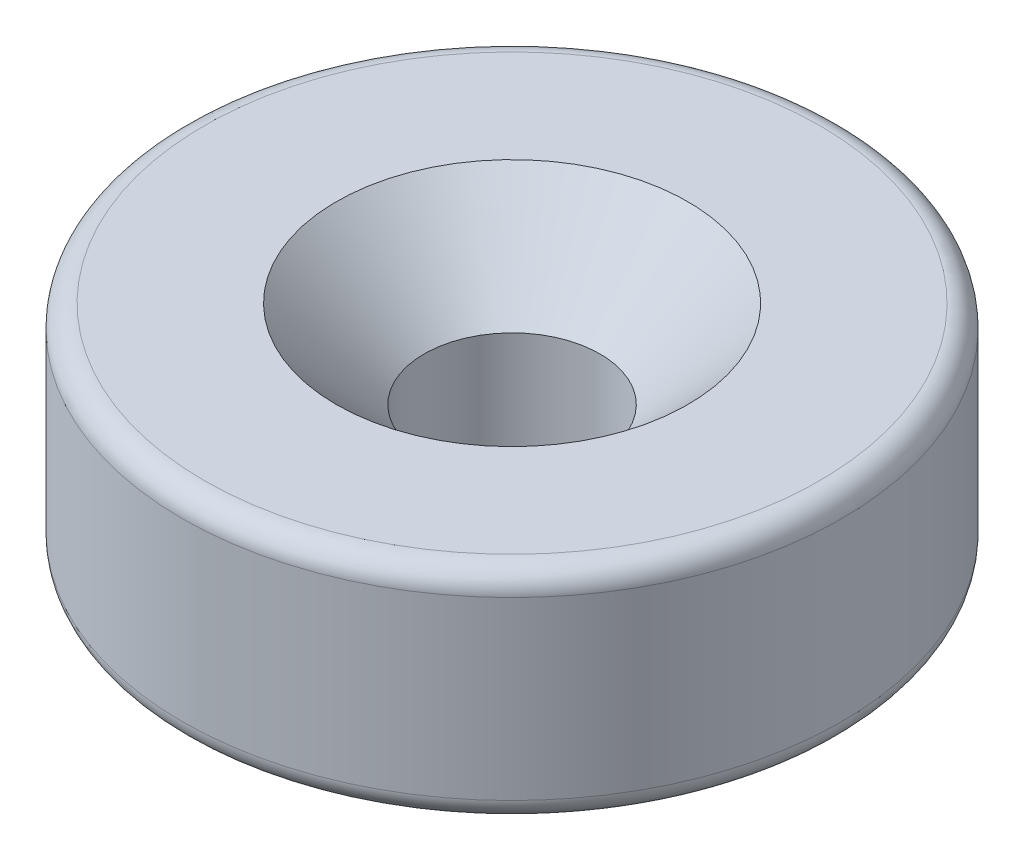
ISO-10303-21;
HEADER;
FILE_DESCRIPTION(('STEP AP214'),'2;1');
FILE_NAME('part.step','',(''),(''),'','','');
FILE_SCHEMA(('AUTOMOTIVE_DESIGN { 1 0 10303 214 1 1 1 1 }'));
ENDSEC;
DATA;
#1=APPLICATION_CONTEXT('core data for automotive mechanical design processes');
#2=APPLICATION_PROTOCOL_DEFINITION('international standard','automotive_design',2000,#1);
#3=PRODUCT_CONTEXT('',#1,'mechanical');
#4=PRODUCT('Part','Part','',(#3));
#5=PRODUCT_RELATED_PRODUCT_CATEGORY('part','',(#4));
#6=PRODUCT_DEFINITION_FORMATION('','',#4);
#7=PRODUCT_DEFINITION_CONTEXT('part definition',#1,'design');
#8=PRODUCT_DEFINITION('design','',#6,#7);
#9=PRODUCT_DEFINITION_SHAPE('','',#8);
#10=(LENGTH_UNIT() NAMED_UNIT(*) SI_UNIT(.MILLI.,.METRE.));
#11=(NAMED_UNIT(*) PLANE_ANGLE_UNIT() SI_UNIT($,.RADIAN.));
#12=(NAMED_UNIT(*) SI_UNIT($,.STERADIAN.) SOLID_ANGLE_UNIT());
#13=UNCERTAINTY_MEASURE_WITH_UNIT(LENGTH_MEASURE(1.E-05),#10,'distance_accuracy_value','');
#14=(GEOMETRIC_REPRESENTATION_CONTEXT(3) GLOBAL_UNCERTAINTY_ASSIGNED_CONTEXT((#13)) GLOBAL_UNIT_ASSIGNED_CONTEXT((#10,
#11,#12)) REPRESENTATION_CONTEXT('',''));
#15=CARTESIAN_POINT('',(0.,0.,0.));
#16=DIRECTION('',(0.,0.,1.));
#17=DIRECTION('',(1.,0.,0.));
#18=AXIS2_PLACEMENT_3D('',#15,#16,#17);
#19=CARTESIAN_POINT('',(0.,2.5,0.));
#20=DIRECTION('',(0.,1.,0.));
#21=DIRECTION('',(0.,0.,1.));
#22=AXIS2_PLACEMENT_3D('',#19,#20,#21);
#23=PLANE('',#22);
#24=CARTESIAN_POINT('',(0.,2.5,0.));
#25=DIRECTION('',(0.,1.,0.));
#26=DIRECTION('',(0.,0.,1.));
#27=AXIS2_PLACEMENT_3D('',#24,#25,#26);
#28=CIRCLE('',#27,4.00000000000001);
#29=CARTESIAN_POINT('',(0.,2.5,4.00000000000001));
#30=VERTEX_POINT('',#29);
#31=EDGE_CURVE('E10',#30,#30,#28,.F.);
#32=ORIENTED_EDGE('',*,*,#31,.T.);
#33=EDGE_LOOP('',(#32));
#34=FACE_BOUND('',#33,.T.);
#35=CARTESIAN_POINT('',(0.,2.5,0.));
#36=DIRECTION('',(0.,1.,0.));
#37=DIRECTION('',(0.,0.,1.));
#38=AXIS2_PLACEMENT_3D('',#35,#36,#37);
#39=CIRCLE('',#38,7.);
#40=CARTESIAN_POINT('',(0.,2.5,7.));
#41=VERTEX_POINT('',#40);
#42=EDGE_CURVE('E42',#41,#41,#39,.T.);
#43=ORIENTED_EDGE('',*,*,#42,.T.);
#44=EDGE_LOOP('',(#43));
#45=FACE_BOUND('',#44,.T.);
#46=ADVANCED_FACE('F31',(#34,#45),#23,.T.);
#47=CARTESIAN_POINT('',(0.,-2.5,0.));
#48=DIRECTION('',(0.,1.,0.));
#49=DIRECTION('',(0.,0.,1.));
#50=AXIS2_PLACEMENT_3D('',#47,#48,#49);
#51=PLANE('',#50);
#52=CARTESIAN_POINT('',(0.,-2.5,0.));
#53=DIRECTION('',(0.,1.,0.));
#54=DIRECTION('',(0.,0.,1.));
#55=AXIS2_PLACEMENT_3D('',#52,#53,#54);
#56=CIRCLE('',#55,7.);
#57=CARTESIAN_POINT('',(0.,-2.5,7.));
#58=VERTEX_POINT('',#57);
#59=EDGE_CURVE('E46',#58,#58,#56,.F.);
#60=ORIENTED_EDGE('',*,*,#59,.T.);
#61=EDGE_LOOP('',(#60));
#62=FACE_BOUND('',#61,.T.);
#63=CARTESIAN_POINT('',(0.,-2.5,0.));
#64=DIRECTION('',(0.,1.,0.));
#65=DIRECTION('',(0.,0.,1.));
#66=AXIS2_PLACEMENT_3D('',#63,#64,#65);
#67=CIRCLE('',#66,2.);
#68=CARTESIAN_POINT('',(0.,-2.5,2.));
#69=VERTEX_POINT('',#68);
#70=EDGE_CURVE('E57',#69,#69,#67,.T.);
#71=ORIENTED_EDGE('',*,*,#70,.T.);
#72=EDGE_LOOP('',(#71));
#73=FACE_BOUND('',#72,.T.);
#74=ADVANCED_FACE('F61',(#62,#73),#51,.F.);
#75=CARTESIAN_POINT('',(0.,2.5,0.));
#76=DIRECTION('',(0.,-1.,0.));
#77=DIRECTION('',(0.,0.,-1.));
#78=AXIS2_PLACEMENT_3D('',#75,#76,#77);
#79=CYLINDRICAL_SURFACE('',#78,7.5);
#80=CARTESIAN_POINT('',(0.,-2.,0.));
#81=DIRECTION('',(0.,1.,0.));
#82=DIRECTION('',(0.,0.,1.));
#83=AXIS2_PLACEMENT_3D('',#80,#81,#82);
#84=CIRCLE('',#83,7.5);
#85=CARTESIAN_POINT('',(0.,-2.,7.5));
#86=VERTEX_POINT('',#85);
#87=EDGE_CURVE('E51',#86,#86,#84,.T.);
#88=ORIENTED_EDGE('',*,*,#87,.T.);
#89=EDGE_LOOP('',(#88));
#90=FACE_BOUND('',#89,.T.);
#91=CARTESIAN_POINT('',(0.,2.,0.));
#92=DIRECTION('',(0.,1.,0.));
#93=DIRECTION('',(0.,0.,1.));
#94=AXIS2_PLACEMENT_3D('',#91,#92,#93);
#95=CIRCLE('',#94,7.5);
#96=CARTESIAN_POINT('',(0.,2.,7.5));
#97=VERTEX_POINT('',#96);
#98=EDGE_CURVE('E54',#97,#97,#95,.F.);
#99=ORIENTED_EDGE('',*,*,#98,.T.);
#100=EDGE_LOOP('',(#99));
#101=FACE_BOUND('',#100,.T.);
#102=ADVANCED_FACE('F66',(#90,#101),#79,.T.);
#103=CARTESIAN_POINT('',(0.,2.5,0.));
#104=DIRECTION('',(0.,-1.,0.));
#105=DIRECTION('',(0.,0.,-1.));
#106=AXIS2_PLACEMENT_3D('',#103,#104,#105);
#107=CYLINDRICAL_SURFACE('',#106,2.);
#108=CARTESIAN_POINT('',(0.,0.500000000000002,0.));
#109=DIRECTION('',(0.,1.,0.));
#110=DIRECTION('',(0.,0.,1.));
#111=AXIS2_PLACEMENT_3D('',#108,#109,#110);
#112=CIRCLE('',#111,2.);
#113=CARTESIAN_POINT('',(0.,0.500000000000002,2.));
#114=VERTEX_POINT('',#113);
#115=EDGE_CURVE('E38',#114,#114,#112,.T.);
#116=ORIENTED_EDGE('',*,*,#115,.T.);
#117=EDGE_LOOP('',(#116));
#118=FACE_BOUND('',#117,.T.);
#119=ORIENTED_EDGE('',*,*,#70,.F.);
#120=EDGE_LOOP('',(#119));
#121=FACE_BOUND('',#120,.T.);
#122=ADVANCED_FACE('F63',(#118,#121),#107,.F.);
#123=CARTESIAN_POINT('',(0.,-2.,0.));
#124=DIRECTION('',(0.,1.,0.));
#125=DIRECTION('',(0.,0.,1.));
#126=AXIS2_PLACEMENT_3D('',#123,#124,#125);
#127=TOROIDAL_SURFACE('',#126,7.,0.5);
#128=ORIENTED_EDGE('',*,*,#59,.F.);
#129=EDGE_LOOP('',(#128));
#130=FACE_BOUND('',#129,.T.);
#131=ORIENTED_EDGE('',*,*,#87,.F.);
#132=EDGE_LOOP('',(#131));
#133=FACE_BOUND('',#132,.T.);
#134=ADVANCED_FACE('F65',(#130,#133),#127,.T.);
#135=CARTESIAN_POINT('',(0.,2.,0.));
#136=DIRECTION('',(0.,1.,0.));
#137=DIRECTION('',(0.,0.,1.));
#138=AXIS2_PLACEMENT_3D('',#135,#136,#137);
#139=TOROIDAL_SURFACE('',#138,7.,0.5);
#140=ORIENTED_EDGE('',*,*,#98,.F.);
#141=EDGE_LOOP('',(#140));
#142=FACE_BOUND('',#141,.T.);
#143=ORIENTED_EDGE('',*,*,#42,.F.);
#144=EDGE_LOOP('',(#143));
#145=FACE_BOUND('',#144,.T.);
#146=ADVANCED_FACE('F72',(#142,#145),#139,.T.);
#147=CARTESIAN_POINT('',(0.,0.500000000000002,0.));
#148=DIRECTION('',(0.,1.,0.));
#149=DIRECTION('',(0.,0.,1.));
#150=AXIS2_PLACEMENT_3D('',#147,#148,#149);
#151=CONICAL_SURFACE('',#150,2.,0.785398163397451);
#152=ORIENTED_EDGE('',*,*,#31,.F.);
#153=EDGE_LOOP('',(#152));
#154=FACE_BOUND('',#153,.T.);
#155=ORIENTED_EDGE('',*,*,#115,.F.);
#156=EDGE_LOOP('',(#155));
#157=FACE_BOUND('',#156,.T.);
#158=ADVANCED_FACE('F33',(#154,#157),#151,.F.);
#159=CLOSED_SHELL('',(#46,#74,#102,#122,#134,#146,#158));
#160=MANIFOLD_SOLID_BREP('B2',#159);
#161=ADVANCED_BREP_SHAPE_REPRESENTATION('',(#18,#160),#14);
#162=SHAPE_DEFINITION_REPRESENTATION(#9,#161);
ENDSEC;
END-ISO-10303-21;
